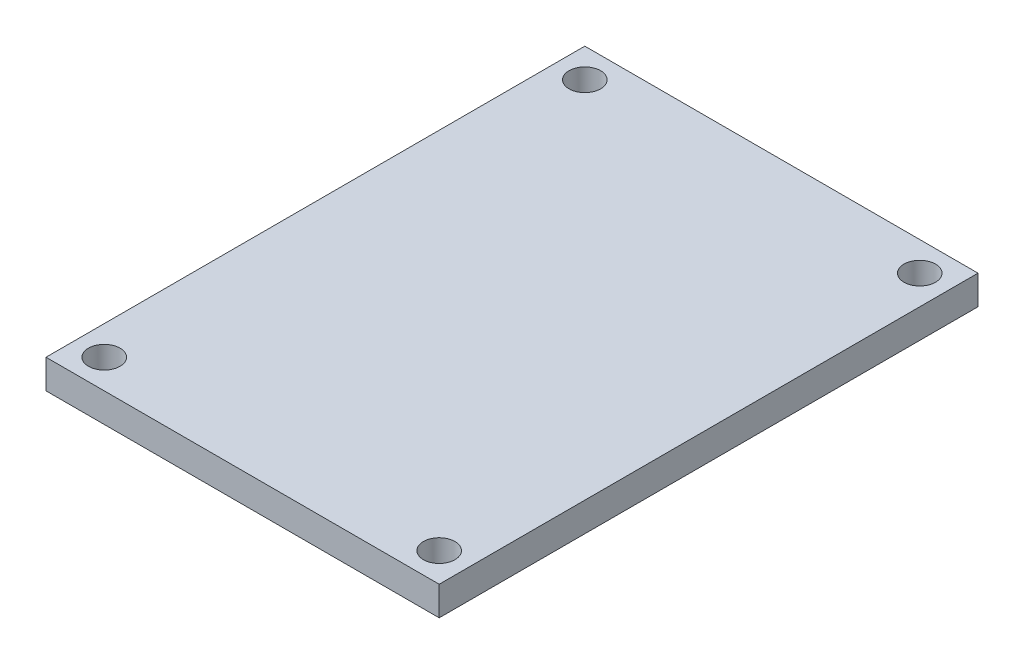
ISO-10303-21;
HEADER;
FILE_DESCRIPTION(('STEP AP214'),'2;1');
FILE_NAME('part.step','',(''),(''),'','','');
FILE_SCHEMA(('AUTOMOTIVE_DESIGN { 1 0 10303 214 1 1 1 1 }'));
ENDSEC;
DATA;
#1=APPLICATION_CONTEXT('core data for automotive mechanical design processes');
#2=APPLICATION_PROTOCOL_DEFINITION('international standard','automotive_design',2000,#1);
#3=PRODUCT_CONTEXT('',#1,'mechanical');
#4=PRODUCT('Part','Part','',(#3));
#5=PRODUCT_RELATED_PRODUCT_CATEGORY('part','',(#4));
#6=PRODUCT_DEFINITION_FORMATION('','',#4);
#7=PRODUCT_DEFINITION_CONTEXT('part definition',#1,'design');
#8=PRODUCT_DEFINITION('design','',#6,#7);
#9=PRODUCT_DEFINITION_SHAPE('','',#8);
#10=(LENGTH_UNIT() NAMED_UNIT(*) SI_UNIT(.MILLI.,.METRE.));
#11=(NAMED_UNIT(*) PLANE_ANGLE_UNIT() SI_UNIT($,.RADIAN.));
#12=(NAMED_UNIT(*) SI_UNIT($,.STERADIAN.) SOLID_ANGLE_UNIT());
#13=UNCERTAINTY_MEASURE_WITH_UNIT(LENGTH_MEASURE(1.E-05),#10,'distance_accuracy_value','');
#14=(GEOMETRIC_REPRESENTATION_CONTEXT(3) GLOBAL_UNCERTAINTY_ASSIGNED_CONTEXT((#13)) GLOBAL_UNIT_ASSIGNED_CONTEXT((#10,
#11,#12)) REPRESENTATION_CONTEXT('',''));
#15=CARTESIAN_POINT('',(0.,0.,0.));
#16=DIRECTION('',(0.,0.,1.));
#17=DIRECTION('',(1.,0.,0.));
#18=AXIS2_PLACEMENT_3D('',#15,#16,#17);
#19=CARTESIAN_POINT('',(20.25,3.,27.75));
#20=DIRECTION('',(-1.,0.,0.));
#21=DIRECTION('',(0.,0.,1.));
#22=AXIS2_PLACEMENT_3D('',#19,#20,#21);
#23=PLANE('',#22);
#24=DIRECTION('',(0.,0.,-1.));
#25=VECTOR('',#24,1.);
#26=CARTESIAN_POINT('',(20.25,0.,27.75));
#27=LINE('',#26,#25);
#28=CARTESIAN_POINT('',(20.25,0.,27.75));
#29=VERTEX_POINT('',#28);
#30=CARTESIAN_POINT('',(20.25,0.,-27.75));
#31=VERTEX_POINT('',#30);
#32=EDGE_CURVE('E107',#29,#31,#27,.T.);
#33=ORIENTED_EDGE('',*,*,#32,.T.);
#34=DIRECTION('',(0.,-1.,0.));
#35=VECTOR('',#34,1.);
#36=CARTESIAN_POINT('',(20.25,3.,-27.75));
#37=LINE('',#36,#35);
#38=CARTESIAN_POINT('',(20.25,3.,-27.75));
#39=VERTEX_POINT('',#38);
#40=EDGE_CURVE('E11',#39,#31,#37,.T.);
#41=ORIENTED_EDGE('',*,*,#40,.F.);
#42=DIRECTION('',(0.,0.,-1.));
#43=VECTOR('',#42,1.);
#44=CARTESIAN_POINT('',(20.25,3.,27.75));
#45=LINE('',#44,#43);
#46=CARTESIAN_POINT('',(20.25,3.,27.75));
#47=VERTEX_POINT('',#46);
#48=EDGE_CURVE('E91',#47,#39,#45,.T.);
#49=ORIENTED_EDGE('',*,*,#48,.F.);
#50=DIRECTION('',(0.,-1.,0.));
#51=VECTOR('',#50,1.);
#52=CARTESIAN_POINT('',(20.25,3.,27.75));
#53=LINE('',#52,#51);
#54=EDGE_CURVE('E103',#47,#29,#53,.T.);
#55=ORIENTED_EDGE('',*,*,#54,.T.);
#56=EDGE_LOOP('',(#33,#41,#49,#55));
#57=FACE_BOUND('',#56,.T.);
#58=ADVANCED_FACE('F39',(#57),#23,.F.);
#59=CARTESIAN_POINT('',(-20.25,3.,-27.75));
#60=DIRECTION('',(0.,0.,1.));
#61=DIRECTION('',(1.,0.,0.));
#62=AXIS2_PLACEMENT_3D('',#59,#60,#61);
#63=PLANE('',#62);
#64=DIRECTION('',(-1.,0.,0.));
#65=VECTOR('',#64,1.);
#66=CARTESIAN_POINT('',(-20.25,0.,-27.75));
#67=LINE('',#66,#65);
#68=CARTESIAN_POINT('',(-20.25,0.,-27.75));
#69=VERTEX_POINT('',#68);
#70=EDGE_CURVE('E96',#31,#69,#67,.T.);
#71=ORIENTED_EDGE('',*,*,#70,.T.);
#72=DIRECTION('',(0.,-1.,0.));
#73=VECTOR('',#72,1.);
#74=CARTESIAN_POINT('',(-20.25,3.,-27.75));
#75=LINE('',#74,#73);
#76=CARTESIAN_POINT('',(-20.25,3.,-27.75));
#77=VERTEX_POINT('',#76);
#78=EDGE_CURVE('E48',#77,#69,#75,.T.);
#79=ORIENTED_EDGE('',*,*,#78,.F.);
#80=DIRECTION('',(-1.,0.,0.));
#81=VECTOR('',#80,1.);
#82=CARTESIAN_POINT('',(-20.25,3.,-27.75));
#83=LINE('',#82,#81);
#84=EDGE_CURVE('E86',#39,#77,#83,.T.);
#85=ORIENTED_EDGE('',*,*,#84,.F.);
#86=ORIENTED_EDGE('',*,*,#40,.T.);
#87=EDGE_LOOP('',(#71,#79,#85,#86));
#88=FACE_BOUND('',#87,.T.);
#89=ADVANCED_FACE('F95',(#88),#63,.F.);
#90=CARTESIAN_POINT('',(-20.25,3.,27.75));
#91=DIRECTION('',(1.,0.,0.));
#92=DIRECTION('',(0.,0.,-1.));
#93=AXIS2_PLACEMENT_3D('',#90,#91,#92);
#94=PLANE('',#93);
#95=DIRECTION('',(0.,0.,1.));
#96=VECTOR('',#95,1.);
#97=CARTESIAN_POINT('',(-20.25,0.,27.75));
#98=LINE('',#97,#96);
#99=CARTESIAN_POINT('',(-20.25,0.,27.75));
#100=VERTEX_POINT('',#99);
#101=EDGE_CURVE('E73',#69,#100,#98,.T.);
#102=ORIENTED_EDGE('',*,*,#101,.T.);
#103=DIRECTION('',(0.,-1.,0.));
#104=VECTOR('',#103,1.);
#105=CARTESIAN_POINT('',(-20.25,3.,27.75));
#106=LINE('',#105,#104);
#107=CARTESIAN_POINT('',(-20.25,3.,27.75));
#108=VERTEX_POINT('',#107);
#109=EDGE_CURVE('E98',#108,#100,#106,.T.);
#110=ORIENTED_EDGE('',*,*,#109,.F.);
#111=DIRECTION('',(0.,0.,1.));
#112=VECTOR('',#111,1.);
#113=CARTESIAN_POINT('',(-20.25,3.,27.75));
#114=LINE('',#113,#112);
#115=EDGE_CURVE('E89',#77,#108,#114,.T.);
#116=ORIENTED_EDGE('',*,*,#115,.F.);
#117=ORIENTED_EDGE('',*,*,#78,.T.);
#118=EDGE_LOOP('',(#102,#110,#116,#117));
#119=FACE_BOUND('',#118,.T.);
#120=ADVANCED_FACE('F99',(#119),#94,.F.);
#121=CARTESIAN_POINT('',(-20.25,3.,27.75));
#122=DIRECTION('',(0.,0.,-1.));
#123=DIRECTION('',(-1.,0.,0.));
#124=AXIS2_PLACEMENT_3D('',#121,#122,#123);
#125=PLANE('',#124);
#126=DIRECTION('',(1.,0.,0.));
#127=VECTOR('',#126,1.);
#128=CARTESIAN_POINT('',(-20.25,0.,27.75));
#129=LINE('',#128,#127);
#130=EDGE_CURVE('E79',#100,#29,#129,.T.);
#131=ORIENTED_EDGE('',*,*,#130,.T.);
#132=ORIENTED_EDGE('',*,*,#54,.F.);
#133=DIRECTION('',(1.,0.,0.));
#134=VECTOR('',#133,1.);
#135=CARTESIAN_POINT('',(-20.25,3.,27.75));
#136=LINE('',#135,#134);
#137=EDGE_CURVE('E56',#108,#47,#136,.T.);
#138=ORIENTED_EDGE('',*,*,#137,.F.);
#139=ORIENTED_EDGE('',*,*,#109,.T.);
#140=EDGE_LOOP('',(#131,#132,#138,#139));
#141=FACE_BOUND('',#140,.T.);
#142=ADVANCED_FACE('F121',(#141),#125,.F.);
#143=CARTESIAN_POINT('',(0.,3.,0.));
#144=DIRECTION('',(0.,-1.,0.));
#145=DIRECTION('',(0.,0.,-1.));
#146=AXIS2_PLACEMENT_3D('',#143,#144,#145);
#147=PLANE('',#146);
#148=CARTESIAN_POINT('',(-17.25,3.,24.75));
#149=DIRECTION('',(0.,-1.,0.));
#150=DIRECTION('',(0.,0.,-1.));
#151=AXIS2_PLACEMENT_3D('',#148,#149,#150);
#152=CIRCLE('',#151,1.625);
#153=CARTESIAN_POINT('',(-17.25,3.,23.125));
#154=VERTEX_POINT('',#153);
#155=EDGE_CURVE('E111',#154,#154,#152,.T.);
#156=ORIENTED_EDGE('',*,*,#155,.T.);
#157=EDGE_LOOP('',(#156));
#158=FACE_BOUND('',#157,.T.);
#159=CARTESIAN_POINT('',(17.25,3.,24.75));
#160=DIRECTION('',(0.,-1.,0.));
#161=DIRECTION('',(0.,0.,-1.));
#162=AXIS2_PLACEMENT_3D('',#159,#160,#161);
#163=CIRCLE('',#162,1.625);
#164=CARTESIAN_POINT('',(17.25,3.,23.125));
#165=VERTEX_POINT('',#164);
#166=EDGE_CURVE('E131',#165,#165,#163,.T.);
#167=ORIENTED_EDGE('',*,*,#166,.T.);
#168=EDGE_LOOP('',(#167));
#169=FACE_BOUND('',#168,.T.);
#170=CARTESIAN_POINT('',(17.25,3.,-24.75));
#171=DIRECTION('',(0.,-1.,0.));
#172=DIRECTION('',(0.,0.,-1.));
#173=AXIS2_PLACEMENT_3D('',#170,#171,#172);
#174=CIRCLE('',#173,1.625);
#175=CARTESIAN_POINT('',(17.25,3.,-26.375));
#176=VERTEX_POINT('',#175);
#177=EDGE_CURVE('E135',#176,#176,#174,.T.);
#178=ORIENTED_EDGE('',*,*,#177,.T.);
#179=EDGE_LOOP('',(#178));
#180=FACE_BOUND('',#179,.T.);
#181=CARTESIAN_POINT('',(-17.25,3.,-24.75));
#182=DIRECTION('',(0.,-1.,0.));
#183=DIRECTION('',(0.,0.,-1.));
#184=AXIS2_PLACEMENT_3D('',#181,#182,#183);
#185=CIRCLE('',#184,1.625);
#186=CARTESIAN_POINT('',(-17.25,3.,-26.375));
#187=VERTEX_POINT('',#186);
#188=EDGE_CURVE('E139',#187,#187,#185,.T.);
#189=ORIENTED_EDGE('',*,*,#188,.T.);
#190=EDGE_LOOP('',(#189));
#191=FACE_BOUND('',#190,.T.);
#192=ORIENTED_EDGE('',*,*,#48,.T.);
#193=ORIENTED_EDGE('',*,*,#84,.T.);
#194=ORIENTED_EDGE('',*,*,#115,.T.);
#195=ORIENTED_EDGE('',*,*,#137,.T.);
#196=EDGE_LOOP('',(#192,#193,#194,#195));
#197=FACE_BOUND('',#196,.T.);
#198=ADVANCED_FACE('F87',(#158,#169,#180,#191,#197),#147,.F.);
#199=CARTESIAN_POINT('',(0.,0.,0.));
#200=DIRECTION('',(0.,-1.,0.));
#201=DIRECTION('',(0.,0.,-1.));
#202=AXIS2_PLACEMENT_3D('',#199,#200,#201);
#203=PLANE('',#202);
#204=CARTESIAN_POINT('',(-17.25,0.,24.75));
#205=DIRECTION('',(0.,1.,0.));
#206=DIRECTION('',(0.,0.,1.));
#207=AXIS2_PLACEMENT_3D('',#204,#205,#206);
#208=CIRCLE('',#207,1.625);
#209=CARTESIAN_POINT('',(-17.25,0.,26.375));
#210=VERTEX_POINT('',#209);
#211=EDGE_CURVE('E148',#210,#210,#208,.T.);
#212=ORIENTED_EDGE('',*,*,#211,.T.);
#213=EDGE_LOOP('',(#212));
#214=FACE_BOUND('',#213,.T.);
#215=CARTESIAN_POINT('',(17.25,0.,24.75));
#216=DIRECTION('',(0.,1.,0.));
#217=DIRECTION('',(0.,0.,1.));
#218=AXIS2_PLACEMENT_3D('',#215,#216,#217);
#219=CIRCLE('',#218,1.625);
#220=CARTESIAN_POINT('',(17.25,0.,26.375));
#221=VERTEX_POINT('',#220);
#222=EDGE_CURVE('E152',#221,#221,#219,.T.);
#223=ORIENTED_EDGE('',*,*,#222,.T.);
#224=EDGE_LOOP('',(#223));
#225=FACE_BOUND('',#224,.T.);
#226=CARTESIAN_POINT('',(17.25,0.,-24.75));
#227=DIRECTION('',(0.,1.,0.));
#228=DIRECTION('',(0.,0.,1.));
#229=AXIS2_PLACEMENT_3D('',#226,#227,#228);
#230=CIRCLE('',#229,1.625);
#231=CARTESIAN_POINT('',(17.25,0.,-23.125));
#232=VERTEX_POINT('',#231);
#233=EDGE_CURVE('E147',#232,#232,#230,.T.);
#234=ORIENTED_EDGE('',*,*,#233,.T.);
#235=EDGE_LOOP('',(#234));
#236=FACE_BOUND('',#235,.T.);
#237=CARTESIAN_POINT('',(-17.25,0.,-24.75));
#238=DIRECTION('',(0.,1.,0.));
#239=DIRECTION('',(0.,0.,1.));
#240=AXIS2_PLACEMENT_3D('',#237,#238,#239);
#241=CIRCLE('',#240,1.625);
#242=CARTESIAN_POINT('',(-17.25,0.,-23.125));
#243=VERTEX_POINT('',#242);
#244=EDGE_CURVE('E143',#243,#243,#241,.T.);
#245=ORIENTED_EDGE('',*,*,#244,.T.);
#246=EDGE_LOOP('',(#245));
#247=FACE_BOUND('',#246,.T.);
#248=ORIENTED_EDGE('',*,*,#32,.F.);
#249=ORIENTED_EDGE('',*,*,#130,.F.);
#250=ORIENTED_EDGE('',*,*,#101,.F.);
#251=ORIENTED_EDGE('',*,*,#70,.F.);
#252=EDGE_LOOP('',(#248,#249,#250,#251));
#253=FACE_BOUND('',#252,.T.);
#254=ADVANCED_FACE('F124',(#214,#225,#236,#247,#253),#203,.T.);
#255=CARTESIAN_POINT('',(-17.25,0.,-24.75));
#256=DIRECTION('',(0.,1.,0.));
#257=DIRECTION('',(0.,0.,1.));
#258=AXIS2_PLACEMENT_3D('',#255,#256,#257);
#259=CYLINDRICAL_SURFACE('',#258,1.625);
#260=ORIENTED_EDGE('',*,*,#244,.F.);
#261=EDGE_LOOP('',(#260));
#262=FACE_BOUND('',#261,.T.);
#263=ORIENTED_EDGE('',*,*,#188,.F.);
#264=EDGE_LOOP('',(#263));
#265=FACE_BOUND('',#264,.T.);
#266=ADVANCED_FACE('F166',(#262,#265),#259,.F.);
#267=CARTESIAN_POINT('',(17.25,0.,-24.75));
#268=DIRECTION('',(0.,1.,0.));
#269=DIRECTION('',(0.,0.,1.));
#270=AXIS2_PLACEMENT_3D('',#267,#268,#269);
#271=CYLINDRICAL_SURFACE('',#270,1.625);
#272=ORIENTED_EDGE('',*,*,#233,.F.);
#273=EDGE_LOOP('',(#272));
#274=FACE_BOUND('',#273,.T.);
#275=ORIENTED_EDGE('',*,*,#177,.F.);
#276=EDGE_LOOP('',(#275));
#277=FACE_BOUND('',#276,.T.);
#278=ADVANCED_FACE('F162',(#274,#277),#271,.F.);
#279=CARTESIAN_POINT('',(17.25,0.,24.75));
#280=DIRECTION('',(0.,1.,0.));
#281=DIRECTION('',(0.,0.,1.));
#282=AXIS2_PLACEMENT_3D('',#279,#280,#281);
#283=CYLINDRICAL_SURFACE('',#282,1.625);
#284=ORIENTED_EDGE('',*,*,#222,.F.);
#285=EDGE_LOOP('',(#284));
#286=FACE_BOUND('',#285,.T.);
#287=ORIENTED_EDGE('',*,*,#166,.F.);
#288=EDGE_LOOP('',(#287));
#289=FACE_BOUND('',#288,.T.);
#290=ADVANCED_FACE('F165',(#286,#289),#283,.F.);
#291=CARTESIAN_POINT('',(-17.25,0.,24.75));
#292=DIRECTION('',(0.,1.,0.));
#293=DIRECTION('',(0.,0.,1.));
#294=AXIS2_PLACEMENT_3D('',#291,#292,#293);
#295=CYLINDRICAL_SURFACE('',#294,1.625);
#296=ORIENTED_EDGE('',*,*,#211,.F.);
#297=EDGE_LOOP('',(#296));
#298=FACE_BOUND('',#297,.T.);
#299=ORIENTED_EDGE('',*,*,#155,.F.);
#300=EDGE_LOOP('',(#299));
#301=FACE_BOUND('',#300,.T.);
#302=ADVANCED_FACE('F227',(#298,#301),#295,.F.);
#303=CLOSED_SHELL('',(#58,#89,#120,#142,#198,#254,#266,#278,#290,#302));
#304=MANIFOLD_SOLID_BREP('B2',#303);
#305=ADVANCED_BREP_SHAPE_REPRESENTATION('',(#18,#304),#14);
#306=SHAPE_DEFINITION_REPRESENTATION(#9,#305);
ENDSEC;
END-ISO-10303-21;
